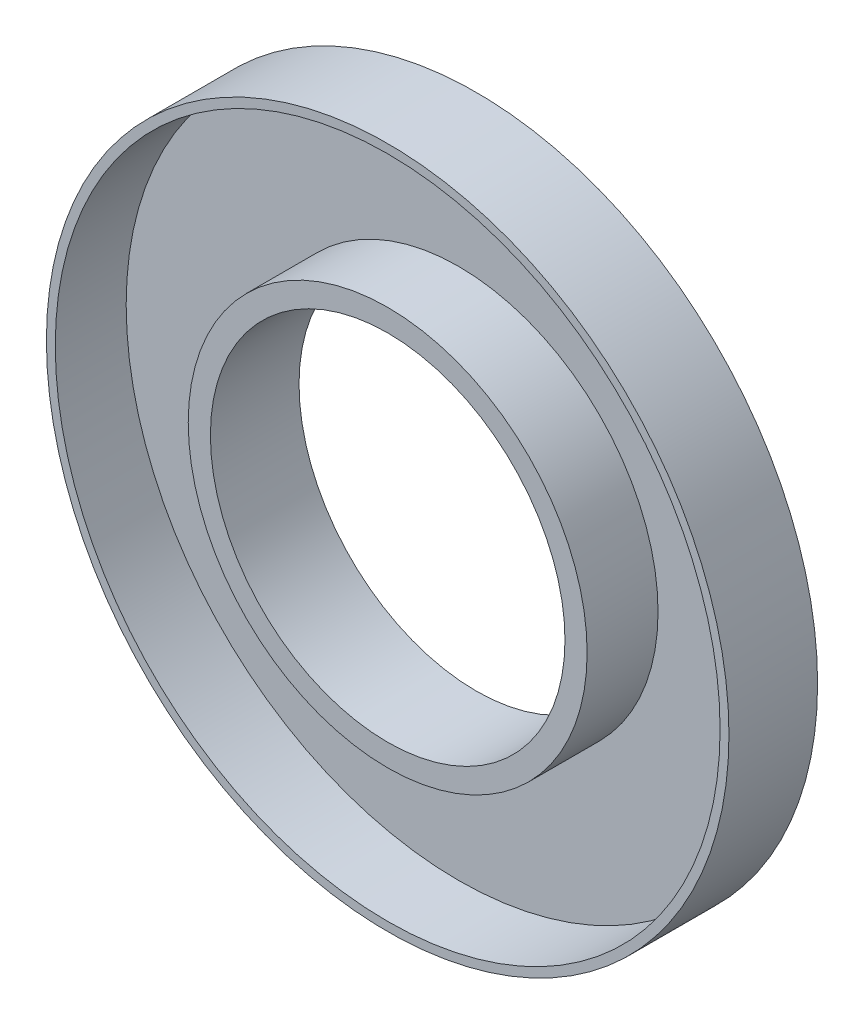
ISO-10303-21;
HEADER;
FILE_DESCRIPTION(('STEP AP214'),'2;1');
FILE_NAME('part.step','',(''),(''),'','','');
FILE_SCHEMA(('AUTOMOTIVE_DESIGN { 1 0 10303 214 1 1 1 1 }'));
ENDSEC;
DATA;
#1=APPLICATION_CONTEXT('core data for automotive mechanical design processes');
#2=APPLICATION_PROTOCOL_DEFINITION('international standard','automotive_design',2000,#1);
#3=PRODUCT_CONTEXT('',#1,'mechanical');
#4=PRODUCT('Part','Part','',(#3));
#5=PRODUCT_RELATED_PRODUCT_CATEGORY('part','',(#4));
#6=PRODUCT_DEFINITION_FORMATION('','',#4);
#7=PRODUCT_DEFINITION_CONTEXT('part definition',#1,'design');
#8=PRODUCT_DEFINITION('design','',#6,#7);
#9=PRODUCT_DEFINITION_SHAPE('','',#8);
#10=(LENGTH_UNIT() NAMED_UNIT(*) SI_UNIT(.MILLI.,.METRE.));
#11=(NAMED_UNIT(*) PLANE_ANGLE_UNIT() SI_UNIT($,.RADIAN.));
#12=(NAMED_UNIT(*) SI_UNIT($,.STERADIAN.) SOLID_ANGLE_UNIT());
#13=UNCERTAINTY_MEASURE_WITH_UNIT(LENGTH_MEASURE(1.E-05),#10,'distance_accuracy_value','');
#14=(GEOMETRIC_REPRESENTATION_CONTEXT(3) GLOBAL_UNCERTAINTY_ASSIGNED_CONTEXT((#13)) GLOBAL_UNIT_ASSIGNED_CONTEXT((#10,
#11,#12)) REPRESENTATION_CONTEXT('',''));
#15=CARTESIAN_POINT('',(0.,0.,0.));
#16=DIRECTION('',(0.,0.,1.));
#17=DIRECTION('',(1.,0.,0.));
#18=AXIS2_PLACEMENT_3D('',#15,#16,#17);
#19=CARTESIAN_POINT('',(0.,0.,1.));
#20=DIRECTION('',(0.,0.,1.));
#21=DIRECTION('',(1.,0.,0.));
#22=AXIS2_PLACEMENT_3D('',#19,#20,#21);
#23=PLANE('',#22);
#24=CARTESIAN_POINT('',(0.,0.,1.));
#25=DIRECTION('',(0.,0.,1.));
#26=DIRECTION('',(1.,0.,0.));
#27=AXIS2_PLACEMENT_3D('',#24,#25,#26);
#28=CIRCLE('',#27,11.25);
#29=CARTESIAN_POINT('',(11.25,0.,1.));
#30=VERTEX_POINT('',#29);
#31=EDGE_CURVE('E44',#30,#30,#28,.T.);
#32=ORIENTED_EDGE('',*,*,#31,.F.);
#33=EDGE_LOOP('',(#32));
#34=FACE_BOUND('',#33,.T.);
#35=CARTESIAN_POINT('',(0.,0.,1.));
#36=DIRECTION('',(0.,0.,1.));
#37=DIRECTION('',(1.,0.,0.));
#38=AXIS2_PLACEMENT_3D('',#35,#36,#37);
#39=CIRCLE('',#38,18.75);
#40=CARTESIAN_POINT('',(18.75,0.,1.));
#41=VERTEX_POINT('',#40);
#42=EDGE_CURVE('E10',#41,#41,#39,.F.);
#43=ORIENTED_EDGE('',*,*,#42,.F.);
#44=EDGE_LOOP('',(#43));
#45=FACE_BOUND('',#44,.T.);
#46=ADVANCED_FACE('F40',(#34,#45),#23,.T.);
#47=CARTESIAN_POINT('',(0.,0.,5.));
#48=DIRECTION('',(0.,0.,1.));
#49=DIRECTION('',(1.,0.,0.));
#50=AXIS2_PLACEMENT_3D('',#47,#48,#49);
#51=PLANE('',#50);
#52=CARTESIAN_POINT('',(0.,0.,5.));
#53=DIRECTION('',(0.,0.,1.));
#54=DIRECTION('',(1.,0.,0.));
#55=AXIS2_PLACEMENT_3D('',#52,#53,#54);
#56=CIRCLE('',#55,11.25);
#57=CARTESIAN_POINT('',(11.25,0.,5.));
#58=VERTEX_POINT('',#57);
#59=EDGE_CURVE('E52',#58,#58,#56,.T.);
#60=ORIENTED_EDGE('',*,*,#59,.T.);
#61=EDGE_LOOP('',(#60));
#62=FACE_BOUND('',#61,.T.);
#63=CARTESIAN_POINT('',(0.,0.,5.));
#64=DIRECTION('',(0.,0.,1.));
#65=DIRECTION('',(1.,0.,0.));
#66=AXIS2_PLACEMENT_3D('',#63,#64,#65);
#67=CIRCLE('',#66,10.);
#68=CARTESIAN_POINT('',(10.,0.,5.));
#69=VERTEX_POINT('',#68);
#70=EDGE_CURVE('E60',#69,#69,#67,.T.);
#71=ORIENTED_EDGE('',*,*,#70,.F.);
#72=EDGE_LOOP('',(#71));
#73=FACE_BOUND('',#72,.T.);
#74=ADVANCED_FACE('F77',(#62,#73),#51,.T.);
#75=CARTESIAN_POINT('',(0.,0.,5.));
#76=DIRECTION('',(0.,0.,-1.));
#77=DIRECTION('',(-1.,0.,0.));
#78=AXIS2_PLACEMENT_3D('',#75,#76,#77);
#79=CYLINDRICAL_SURFACE('',#78,11.25);
#80=ORIENTED_EDGE('',*,*,#59,.F.);
#81=EDGE_LOOP('',(#80));
#82=FACE_BOUND('',#81,.T.);
#83=ORIENTED_EDGE('',*,*,#31,.T.);
#84=EDGE_LOOP('',(#83));
#85=FACE_BOUND('',#84,.T.);
#86=ADVANCED_FACE('F87',(#82,#85),#79,.T.);
#87=CARTESIAN_POINT('',(0.,0.,5.));
#88=DIRECTION('',(0.,0.,-1.));
#89=DIRECTION('',(-1.,0.,0.));
#90=AXIS2_PLACEMENT_3D('',#87,#88,#89);
#91=CYLINDRICAL_SURFACE('',#90,10.);
#92=ORIENTED_EDGE('',*,*,#70,.T.);
#93=EDGE_LOOP('',(#92));
#94=FACE_BOUND('',#93,.T.);
#95=CARTESIAN_POINT('',(0.,0.,0.));
#96=DIRECTION('',(0.,0.,1.));
#97=DIRECTION('',(1.,0.,0.));
#98=AXIS2_PLACEMENT_3D('',#95,#96,#97);
#99=CIRCLE('',#98,10.);
#100=CARTESIAN_POINT('',(10.,0.,0.));
#101=VERTEX_POINT('',#100);
#102=EDGE_CURVE('E41',#101,#101,#99,.T.);
#103=ORIENTED_EDGE('',*,*,#102,.F.);
#104=EDGE_LOOP('',(#103));
#105=FACE_BOUND('',#104,.T.);
#106=ADVANCED_FACE('F91',(#94,#105),#91,.F.);
#107=CARTESIAN_POINT('',(0.,0.,59.4472221513642));
#108=DIRECTION('',(0.,0.,-1.));
#109=DIRECTION('',(-1.,0.,0.));
#110=AXIS2_PLACEMENT_3D('',#107,#108,#109);
#111=CYLINDRICAL_SURFACE('',#110,18.75);
#112=ORIENTED_EDGE('',*,*,#42,.T.);
#113=EDGE_LOOP('',(#112));
#114=FACE_BOUND('',#113,.T.);
#115=CARTESIAN_POINT('',(0.,0.,5.));
#116=DIRECTION('',(0.,0.,1.));
#117=DIRECTION('',(1.,0.,0.));
#118=AXIS2_PLACEMENT_3D('',#115,#116,#117);
#119=CIRCLE('',#118,18.75);
#120=CARTESIAN_POINT('',(18.75,0.,5.));
#121=VERTEX_POINT('',#120);
#122=EDGE_CURVE('E63',#121,#121,#119,.T.);
#123=ORIENTED_EDGE('',*,*,#122,.T.);
#124=EDGE_LOOP('',(#123));
#125=FACE_BOUND('',#124,.T.);
#126=ADVANCED_FACE('F100',(#114,#125),#111,.F.);
#127=CARTESIAN_POINT('',(0.,0.,5.));
#128=DIRECTION('',(0.,0.,1.));
#129=DIRECTION('',(1.,0.,0.));
#130=AXIS2_PLACEMENT_3D('',#127,#128,#129);
#131=PLANE('',#130);
#132=ORIENTED_EDGE('',*,*,#122,.F.);
#133=EDGE_LOOP('',(#132));
#134=FACE_BOUND('',#133,.T.);
#135=CARTESIAN_POINT('',(0.,0.,5.));
#136=DIRECTION('',(0.,0.,1.));
#137=DIRECTION('',(1.,0.,0.));
#138=AXIS2_PLACEMENT_3D('',#135,#136,#137);
#139=CIRCLE('',#138,19.25);
#140=CARTESIAN_POINT('',(19.25,0.,5.));
#141=VERTEX_POINT('',#140);
#142=EDGE_CURVE('E58',#141,#141,#139,.T.);
#143=ORIENTED_EDGE('',*,*,#142,.T.);
#144=EDGE_LOOP('',(#143));
#145=FACE_BOUND('',#144,.T.);
#146=ADVANCED_FACE('F70',(#134,#145),#131,.T.);
#147=CARTESIAN_POINT('',(0.,0.,0.));
#148=DIRECTION('',(0.,0.,1.));
#149=DIRECTION('',(1.,0.,0.));
#150=AXIS2_PLACEMENT_3D('',#147,#148,#149);
#151=PLANE('',#150);
#152=ORIENTED_EDGE('',*,*,#102,.T.);
#153=EDGE_LOOP('',(#152));
#154=FACE_BOUND('',#153,.T.);
#155=CARTESIAN_POINT('',(0.,0.,0.));
#156=DIRECTION('',(0.,0.,1.));
#157=DIRECTION('',(1.,0.,0.));
#158=AXIS2_PLACEMENT_3D('',#155,#156,#157);
#159=CIRCLE('',#158,19.25);
#160=CARTESIAN_POINT('',(19.25,0.,0.));
#161=VERTEX_POINT('',#160);
#162=EDGE_CURVE('E47',#161,#161,#159,.T.);
#163=ORIENTED_EDGE('',*,*,#162,.F.);
#164=EDGE_LOOP('',(#163));
#165=FACE_BOUND('',#164,.T.);
#166=ADVANCED_FACE('F67',(#154,#165),#151,.F.);
#167=CARTESIAN_POINT('',(0.,0.,1.));
#168=DIRECTION('',(0.,0.,-1.));
#169=DIRECTION('',(-1.,0.,0.));
#170=AXIS2_PLACEMENT_3D('',#167,#168,#169);
#171=CYLINDRICAL_SURFACE('',#170,19.25);
#172=ORIENTED_EDGE('',*,*,#162,.T.);
#173=EDGE_LOOP('',(#172));
#174=FACE_BOUND('',#173,.T.);
#175=ORIENTED_EDGE('',*,*,#142,.F.);
#176=EDGE_LOOP('',(#175));
#177=FACE_BOUND('',#176,.T.);
#178=ADVANCED_FACE('F39',(#174,#177),#171,.T.);
#179=CLOSED_SHELL('',(#46,#74,#86,#106,#126,#146,#166,#178));
#180=MANIFOLD_SOLID_BREP('B2',#179);
#181=ADVANCED_BREP_SHAPE_REPRESENTATION('',(#18,#180),#14);
#182=SHAPE_DEFINITION_REPRESENTATION(#9,#181);
ENDSEC;
END-ISO-10303-21;
